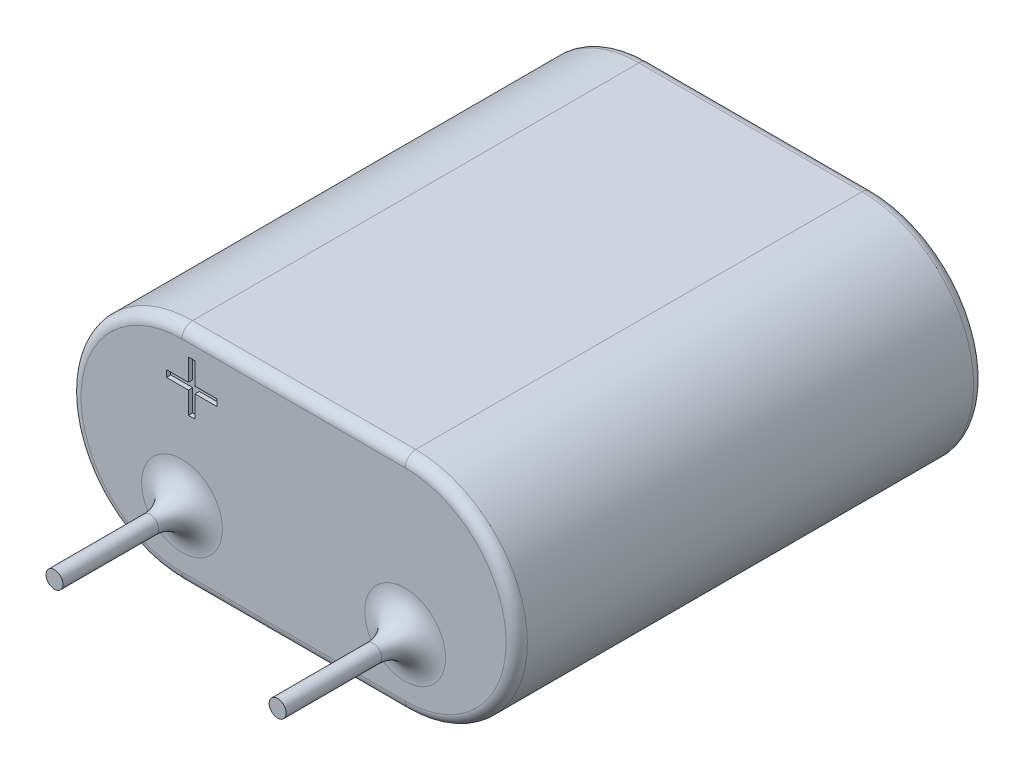
ISO-10303-21;
HEADER;
FILE_DESCRIPTION(('STEP AP214'),'2;1');
FILE_NAME('part.step','',(''),(''),'','','');
FILE_SCHEMA(('AUTOMOTIVE_DESIGN { 1 0 10303 214 1 1 1 1 }'));
ENDSEC;
DATA;
#1=APPLICATION_CONTEXT('core data for automotive mechanical design processes');
#2=APPLICATION_PROTOCOL_DEFINITION('international standard','automotive_design',2000,#1);
#3=PRODUCT_CONTEXT('',#1,'mechanical');
#4=PRODUCT('Part','Part','',(#3));
#5=PRODUCT_RELATED_PRODUCT_CATEGORY('part','',(#4));
#6=PRODUCT_DEFINITION_FORMATION('','',#4);
#7=PRODUCT_DEFINITION_CONTEXT('part definition',#1,'design');
#8=PRODUCT_DEFINITION('design','',#6,#7);
#9=PRODUCT_DEFINITION_SHAPE('','',#8);
#10=(LENGTH_UNIT() NAMED_UNIT(*) SI_UNIT(.MILLI.,.METRE.));
#11=(NAMED_UNIT(*) PLANE_ANGLE_UNIT() SI_UNIT($,.RADIAN.));
#12=(NAMED_UNIT(*) SI_UNIT($,.STERADIAN.) SOLID_ANGLE_UNIT());
#13=UNCERTAINTY_MEASURE_WITH_UNIT(LENGTH_MEASURE(1.E-05),#10,'distance_accuracy_value','');
#14=(GEOMETRIC_REPRESENTATION_CONTEXT(3) GLOBAL_UNCERTAINTY_ASSIGNED_CONTEXT((#13)) GLOBAL_UNIT_ASSIGNED_CONTEXT((#10,
#11,#12)) REPRESENTATION_CONTEXT('',''));
#15=CARTESIAN_POINT('',(0.,0.,0.));
#16=DIRECTION('',(0.,0.,1.));
#17=DIRECTION('',(1.,0.,0.));
#18=AXIS2_PLACEMENT_3D('',#15,#16,#17);
#19=CARTESIAN_POINT('',(0.,0.,0.));
#20=DIRECTION('',(0.,0.,1.));
#21=DIRECTION('',(1.,0.,0.));
#22=AXIS2_PLACEMENT_3D('',#19,#20,#21);
#23=PLANE('',#22);
#24=CARTESIAN_POINT('',(10.5,0.,0.));
#25=DIRECTION('',(0.,0.,1.));
#26=DIRECTION('',(1.,0.,0.));
#27=AXIS2_PLACEMENT_3D('',#24,#25,#26);
#28=CIRCLE('',#27,4.75);
#29=CARTESIAN_POINT('',(10.5,-4.75,0.));
#30=VERTEX_POINT('',#29);
#31=CARTESIAN_POINT('',(10.5,4.75,0.));
#32=VERTEX_POINT('',#31);
#33=EDGE_CURVE('E48',#30,#32,#28,.T.);
#34=ORIENTED_EDGE('',*,*,#33,.T.);
#35=DIRECTION('',(-1.,0.,0.));
#36=VECTOR('',#35,1.);
#37=CARTESIAN_POINT('',(0.,4.75,0.));
#38=LINE('',#37,#36);
#39=CARTESIAN_POINT('',(0.,4.75,0.));
#40=VERTEX_POINT('',#39);
#41=EDGE_CURVE('E11',#32,#40,#38,.T.);
#42=ORIENTED_EDGE('',*,*,#41,.T.);
#43=CARTESIAN_POINT('',(0.,0.,0.));
#44=DIRECTION('',(0.,0.,1.));
#45=DIRECTION('',(1.,0.,0.));
#46=AXIS2_PLACEMENT_3D('',#43,#44,#45);
#47=CIRCLE('',#46,4.75);
#48=CARTESIAN_POINT('',(0.,-4.75,0.));
#49=VERTEX_POINT('',#48);
#50=EDGE_CURVE('E265',#40,#49,#47,.T.);
#51=ORIENTED_EDGE('',*,*,#50,.T.);
#52=DIRECTION('',(1.,0.,0.));
#53=VECTOR('',#52,1.);
#54=CARTESIAN_POINT('',(0.,-4.75,0.));
#55=LINE('',#54,#53);
#56=EDGE_CURVE('E267',#49,#30,#55,.T.);
#57=ORIENTED_EDGE('',*,*,#56,.T.);
#58=EDGE_LOOP('',(#34,#42,#51,#57));
#59=FACE_BOUND('',#58,.T.);
#60=CARTESIAN_POINT('',(10.5,-2.05,0.));
#61=DIRECTION('',(0.,0.,1.));
#62=DIRECTION('',(1.,0.,0.));
#63=AXIS2_PLACEMENT_3D('',#60,#61,#62);
#64=CIRCLE('',#63,1.9);
#65=CARTESIAN_POINT('',(12.4,-2.05,0.));
#66=VERTEX_POINT('',#65);
#67=EDGE_CURVE('E232',#66,#66,#64,.F.);
#68=ORIENTED_EDGE('',*,*,#67,.T.);
#69=EDGE_LOOP('',(#68));
#70=FACE_BOUND('',#69,.T.);
#71=CARTESIAN_POINT('',(0.,-2.05,0.));
#72=DIRECTION('',(0.,0.,1.));
#73=DIRECTION('',(1.,0.,0.));
#74=AXIS2_PLACEMENT_3D('',#71,#72,#73);
#75=CIRCLE('',#74,1.9);
#76=CARTESIAN_POINT('',(1.9,-2.05,0.));
#77=VERTEX_POINT('',#76);
#78=EDGE_CURVE('E229',#77,#77,#75,.F.);
#79=ORIENTED_EDGE('',*,*,#78,.T.);
#80=EDGE_LOOP('',(#79));
#81=FACE_BOUND('',#80,.T.);
#82=DIRECTION('',(0.,1.,0.));
#83=VECTOR('',#82,1.);
#84=CARTESIAN_POINT('',(-0.73076923076923,2.82051282051282,0.));
#85=LINE('',#84,#83);
#86=CARTESIAN_POINT('',(-0.73076923076923,2.82051282051282,0.));
#87=VERTEX_POINT('',#86);
#88=CARTESIAN_POINT('',(-0.73076923076923,3.13461538461538,0.));
#89=VERTEX_POINT('',#88);
#90=EDGE_CURVE('E193',#87,#89,#85,.T.);
#91=ORIENTED_EDGE('',*,*,#90,.T.);
#92=DIRECTION('',(1.,0.,0.));
#93=VECTOR('',#92,1.);
#94=CARTESIAN_POINT('',(-0.73076923076923,3.13461538461538,0.));
#95=LINE('',#94,#93);
#96=CARTESIAN_POINT('',(0.301282051282052,3.13461538461538,0.));
#97=VERTEX_POINT('',#96);
#98=EDGE_CURVE('E56',#89,#97,#95,.T.);
#99=ORIENTED_EDGE('',*,*,#98,.T.);
#100=DIRECTION('',(0.,1.,0.));
#101=VECTOR('',#100,1.);
#102=CARTESIAN_POINT('',(0.301282051282052,3.13461538461538,0.));
#103=LINE('',#102,#101);
#104=CARTESIAN_POINT('',(0.301282051282052,4.16666666666667,0.));
#105=VERTEX_POINT('',#104);
#106=EDGE_CURVE('E197',#97,#105,#103,.T.);
#107=ORIENTED_EDGE('',*,*,#106,.T.);
#108=DIRECTION('',(1.,0.,0.));
#109=VECTOR('',#108,1.);
#110=CARTESIAN_POINT('',(0.301282051282052,4.16666666666667,0.));
#111=LINE('',#110,#109);
#112=CARTESIAN_POINT('',(0.615384615384616,4.16666666666667,0.));
#113=VERTEX_POINT('',#112);
#114=EDGE_CURVE('E643',#105,#113,#111,.T.);
#115=ORIENTED_EDGE('',*,*,#114,.T.);
#116=DIRECTION('',(0.,-1.,0.));
#117=VECTOR('',#116,1.);
#118=CARTESIAN_POINT('',(0.615384615384616,4.16666666666667,0.));
#119=LINE('',#118,#117);
#120=CARTESIAN_POINT('',(0.615384615384616,3.13461538461538,0.));
#121=VERTEX_POINT('',#120);
#122=EDGE_CURVE('E645',#113,#121,#119,.T.);
#123=ORIENTED_EDGE('',*,*,#122,.T.);
#124=DIRECTION('',(1.,0.,0.));
#125=VECTOR('',#124,1.);
#126=CARTESIAN_POINT('',(0.615384615384616,3.13461538461538,0.));
#127=LINE('',#126,#125);
#128=CARTESIAN_POINT('',(1.6474358974359,3.13461538461538,0.));
#129=VERTEX_POINT('',#128);
#130=EDGE_CURVE('E649',#121,#129,#127,.T.);
#131=ORIENTED_EDGE('',*,*,#130,.T.);
#132=DIRECTION('',(0.,-1.,0.));
#133=VECTOR('',#132,1.);
#134=CARTESIAN_POINT('',(1.6474358974359,3.13461538461538,0.));
#135=LINE('',#134,#133);
#136=CARTESIAN_POINT('',(1.6474358974359,2.82051282051282,0.));
#137=VERTEX_POINT('',#136);
#138=EDGE_CURVE('E656',#129,#137,#135,.T.);
#139=ORIENTED_EDGE('',*,*,#138,.T.);
#140=DIRECTION('',(-1.,0.,0.));
#141=VECTOR('',#140,1.);
#142=CARTESIAN_POINT('',(1.6474358974359,2.82051282051282,0.));
#143=LINE('',#142,#141);
#144=CARTESIAN_POINT('',(0.615384615384616,2.82051282051282,0.));
#145=VERTEX_POINT('',#144);
#146=EDGE_CURVE('E659',#137,#145,#143,.T.);
#147=ORIENTED_EDGE('',*,*,#146,.T.);
#148=DIRECTION('',(0.,-1.,0.));
#149=VECTOR('',#148,1.);
#150=CARTESIAN_POINT('',(0.615384615384616,2.82051282051282,0.));
#151=LINE('',#150,#149);
#152=CARTESIAN_POINT('',(0.615384615384616,1.78846153846154,0.));
#153=VERTEX_POINT('',#152);
#154=EDGE_CURVE('E662',#145,#153,#151,.T.);
#155=ORIENTED_EDGE('',*,*,#154,.T.);
#156=DIRECTION('',(-1.,0.,0.));
#157=VECTOR('',#156,1.);
#158=CARTESIAN_POINT('',(0.615384615384616,1.78846153846154,0.));
#159=LINE('',#158,#157);
#160=CARTESIAN_POINT('',(0.301282051282052,1.78846153846154,0.));
#161=VERTEX_POINT('',#160);
#162=EDGE_CURVE('E619',#153,#161,#159,.T.);
#163=ORIENTED_EDGE('',*,*,#162,.T.);
#164=DIRECTION('',(0.,1.,0.));
#165=VECTOR('',#164,1.);
#166=CARTESIAN_POINT('',(0.301282051282052,1.78846153846154,0.));
#167=LINE('',#166,#165);
#168=CARTESIAN_POINT('',(0.301282051282052,2.82051282051282,0.));
#169=VERTEX_POINT('',#168);
#170=EDGE_CURVE('E616',#161,#169,#167,.T.);
#171=ORIENTED_EDGE('',*,*,#170,.T.);
#172=DIRECTION('',(-1.,0.,0.));
#173=VECTOR('',#172,1.);
#174=CARTESIAN_POINT('',(0.301282051282052,2.82051282051282,0.));
#175=LINE('',#174,#173);
#176=EDGE_CURVE('E610',#169,#87,#175,.T.);
#177=ORIENTED_EDGE('',*,*,#176,.T.);
#178=EDGE_LOOP('',(#91,#99,#107,#115,#123,#131,#139,#147,#155,#163,#171,#177));
#179=FACE_BOUND('',#178,.T.);
#180=ADVANCED_FACE('F39',(#59,#70,#81,#179),#23,.T.);
#181=CARTESIAN_POINT('',(0.,0.,-22.));
#182=DIRECTION('',(0.,0.,1.));
#183=DIRECTION('',(1.,0.,0.));
#184=AXIS2_PLACEMENT_3D('',#181,#182,#183);
#185=CYLINDRICAL_SURFACE('',#184,5.25);
#186=DIRECTION('',(0.,0.,1.));
#187=VECTOR('',#186,1.);
#188=CARTESIAN_POINT('',(0.,5.25,-22.));
#189=LINE('',#188,#187);
#190=CARTESIAN_POINT('',(0.,5.25,-21.5));
#191=VERTEX_POINT('',#190);
#192=CARTESIAN_POINT('',(0.,5.25,-0.5));
#193=VERTEX_POINT('',#192);
#194=EDGE_CURVE('E215',#191,#193,#189,.T.);
#195=ORIENTED_EDGE('',*,*,#194,.F.);
#196=CARTESIAN_POINT('',(0.,0.,-21.5));
#197=DIRECTION('',(0.,0.,1.));
#198=DIRECTION('',(1.,0.,0.));
#199=AXIS2_PLACEMENT_3D('',#196,#197,#198);
#200=CIRCLE('',#199,5.25);
#201=CARTESIAN_POINT('',(0.,-5.25,-21.5));
#202=VERTEX_POINT('',#201);
#203=EDGE_CURVE('E263',#191,#202,#200,.T.);
#204=ORIENTED_EDGE('',*,*,#203,.T.);
#205=DIRECTION('',(0.,0.,1.));
#206=VECTOR('',#205,1.);
#207=CARTESIAN_POINT('',(0.,-5.25,-22.));
#208=LINE('',#207,#206);
#209=CARTESIAN_POINT('',(0.,-5.25,-0.5));
#210=VERTEX_POINT('',#209);
#211=EDGE_CURVE('E214',#202,#210,#208,.T.);
#212=ORIENTED_EDGE('',*,*,#211,.T.);
#213=CARTESIAN_POINT('',(0.,0.,-0.5));
#214=DIRECTION('',(0.,0.,1.));
#215=DIRECTION('',(1.,0.,0.));
#216=AXIS2_PLACEMENT_3D('',#213,#214,#215);
#217=CIRCLE('',#216,5.25);
#218=EDGE_CURVE('E261',#210,#193,#217,.F.);
#219=ORIENTED_EDGE('',*,*,#218,.T.);
#220=EDGE_LOOP('',(#195,#204,#212,#219));
#221=FACE_BOUND('',#220,.T.);
#222=ADVANCED_FACE('F300',(#221),#185,.T.);
#223=CARTESIAN_POINT('',(0.,5.25,-22.));
#224=DIRECTION('',(0.,1.,0.));
#225=DIRECTION('',(-1.,0.,0.));
#226=AXIS2_PLACEMENT_3D('',#223,#224,#225);
#227=PLANE('',#226);
#228=DIRECTION('',(0.,0.,1.));
#229=VECTOR('',#228,1.);
#230=CARTESIAN_POINT('',(10.5,5.25,-22.));
#231=LINE('',#230,#229);
#232=CARTESIAN_POINT('',(10.5,5.25,-21.5));
#233=VERTEX_POINT('',#232);
#234=CARTESIAN_POINT('',(10.5,5.25,-0.5));
#235=VERTEX_POINT('',#234);
#236=EDGE_CURVE('E219',#233,#235,#231,.T.);
#237=ORIENTED_EDGE('',*,*,#236,.F.);
#238=DIRECTION('',(-1.,0.,0.));
#239=VECTOR('',#238,1.);
#240=CARTESIAN_POINT('',(0.,5.25,-21.5));
#241=LINE('',#240,#239);
#242=EDGE_CURVE('E259',#233,#191,#241,.T.);
#243=ORIENTED_EDGE('',*,*,#242,.T.);
#244=ORIENTED_EDGE('',*,*,#194,.T.);
#245=DIRECTION('',(-1.,0.,0.));
#246=VECTOR('',#245,1.);
#247=CARTESIAN_POINT('',(0.,5.25,-0.5));
#248=LINE('',#247,#246);
#249=EDGE_CURVE('E256',#193,#235,#248,.F.);
#250=ORIENTED_EDGE('',*,*,#249,.T.);
#251=EDGE_LOOP('',(#237,#243,#244,#250));
#252=FACE_BOUND('',#251,.T.);
#253=ADVANCED_FACE('F317',(#252),#227,.T.);
#254=CARTESIAN_POINT('',(10.5,0.,-22.));
#255=DIRECTION('',(0.,0.,1.));
#256=DIRECTION('',(1.,0.,0.));
#257=AXIS2_PLACEMENT_3D('',#254,#255,#256);
#258=CYLINDRICAL_SURFACE('',#257,5.25);
#259=DIRECTION('',(0.,0.,1.));
#260=VECTOR('',#259,1.);
#261=CARTESIAN_POINT('',(10.5,-5.25,-22.));
#262=LINE('',#261,#260);
#263=CARTESIAN_POINT('',(10.5,-5.25,-21.5));
#264=VERTEX_POINT('',#263);
#265=CARTESIAN_POINT('',(10.5,-5.25,-0.5));
#266=VERTEX_POINT('',#265);
#267=EDGE_CURVE('E222',#264,#266,#262,.T.);
#268=ORIENTED_EDGE('',*,*,#267,.F.);
#269=CARTESIAN_POINT('',(10.5,0.,-21.5));
#270=DIRECTION('',(0.,0.,1.));
#271=DIRECTION('',(1.,0.,0.));
#272=AXIS2_PLACEMENT_3D('',#269,#270,#271);
#273=CIRCLE('',#272,5.25);
#274=EDGE_CURVE('E254',#264,#233,#273,.T.);
#275=ORIENTED_EDGE('',*,*,#274,.T.);
#276=ORIENTED_EDGE('',*,*,#236,.T.);
#277=CARTESIAN_POINT('',(10.5,0.,-0.5));
#278=DIRECTION('',(0.,0.,1.));
#279=DIRECTION('',(1.,0.,0.));
#280=AXIS2_PLACEMENT_3D('',#277,#278,#279);
#281=CIRCLE('',#280,5.25);
#282=EDGE_CURVE('E252',#235,#266,#281,.F.);
#283=ORIENTED_EDGE('',*,*,#282,.T.);
#284=EDGE_LOOP('',(#268,#275,#276,#283));
#285=FACE_BOUND('',#284,.T.);
#286=ADVANCED_FACE('F313',(#285),#258,.T.);
#287=CARTESIAN_POINT('',(0.,-5.25,-22.));
#288=DIRECTION('',(0.,-1.,0.));
#289=DIRECTION('',(1.,0.,0.));
#290=AXIS2_PLACEMENT_3D('',#287,#288,#289);
#291=PLANE('',#290);
#292=ORIENTED_EDGE('',*,*,#211,.F.);
#293=DIRECTION('',(1.,0.,0.));
#294=VECTOR('',#293,1.);
#295=CARTESIAN_POINT('',(10.5,-5.25,-21.5));
#296=LINE('',#295,#294);
#297=EDGE_CURVE('E240',#202,#264,#296,.T.);
#298=ORIENTED_EDGE('',*,*,#297,.T.);
#299=ORIENTED_EDGE('',*,*,#267,.T.);
#300=DIRECTION('',(1.,0.,0.));
#301=VECTOR('',#300,1.);
#302=CARTESIAN_POINT('',(0.,-5.25,-0.5));
#303=LINE('',#302,#301);
#304=EDGE_CURVE('E238',#266,#210,#303,.F.);
#305=ORIENTED_EDGE('',*,*,#304,.T.);
#306=EDGE_LOOP('',(#292,#298,#299,#305));
#307=FACE_BOUND('',#306,.T.);
#308=ADVANCED_FACE('F295',(#307),#291,.T.);
#309=CARTESIAN_POINT('',(0.,0.,-22.));
#310=DIRECTION('',(0.,0.,1.));
#311=DIRECTION('',(1.,0.,0.));
#312=AXIS2_PLACEMENT_3D('',#309,#310,#311);
#313=PLANE('',#312);
#314=CARTESIAN_POINT('',(10.5,0.,-22.));
#315=DIRECTION('',(0.,0.,1.));
#316=DIRECTION('',(1.,0.,0.));
#317=AXIS2_PLACEMENT_3D('',#314,#315,#316);
#318=CIRCLE('',#317,4.75);
#319=CARTESIAN_POINT('',(10.5,4.75,-22.));
#320=VERTEX_POINT('',#319);
#321=CARTESIAN_POINT('',(10.5,-4.75,-22.));
#322=VERTEX_POINT('',#321);
#323=EDGE_CURVE('E247',#320,#322,#318,.F.);
#324=ORIENTED_EDGE('',*,*,#323,.T.);
#325=DIRECTION('',(1.,0.,0.));
#326=VECTOR('',#325,1.);
#327=CARTESIAN_POINT('',(0.,-4.75,-22.));
#328=LINE('',#327,#326);
#329=CARTESIAN_POINT('',(0.,-4.75,-22.));
#330=VERTEX_POINT('',#329);
#331=EDGE_CURVE('E249',#322,#330,#328,.F.);
#332=ORIENTED_EDGE('',*,*,#331,.T.);
#333=CARTESIAN_POINT('',(0.,0.,-22.));
#334=DIRECTION('',(0.,0.,1.));
#335=DIRECTION('',(1.,0.,0.));
#336=AXIS2_PLACEMENT_3D('',#333,#334,#335);
#337=CIRCLE('',#336,4.75);
#338=CARTESIAN_POINT('',(0.,4.75,-22.));
#339=VERTEX_POINT('',#338);
#340=EDGE_CURVE('E243',#330,#339,#337,.F.);
#341=ORIENTED_EDGE('',*,*,#340,.T.);
#342=DIRECTION('',(-1.,0.,0.));
#343=VECTOR('',#342,1.);
#344=CARTESIAN_POINT('',(10.5,4.75,-22.));
#345=LINE('',#344,#343);
#346=EDGE_CURVE('E245',#339,#320,#345,.F.);
#347=ORIENTED_EDGE('',*,*,#346,.T.);
#348=EDGE_LOOP('',(#324,#332,#341,#347));
#349=FACE_BOUND('',#348,.T.);
#350=ADVANCED_FACE('F327',(#349),#313,.F.);
#351=CARTESIAN_POINT('',(0.,-2.05,6.));
#352=DIRECTION('',(0.,0.,1.));
#353=DIRECTION('',(1.,0.,0.));
#354=AXIS2_PLACEMENT_3D('',#351,#352,#353);
#355=PLANE('',#354);
#356=CARTESIAN_POINT('',(0.,-2.05,6.));
#357=DIRECTION('',(0.,0.,1.));
#358=DIRECTION('',(1.,0.,0.));
#359=AXIS2_PLACEMENT_3D('',#356,#357,#358);
#360=CIRCLE('',#359,0.4);
#361=CARTESIAN_POINT('',(0.4,-2.05,6.));
#362=VERTEX_POINT('',#361);
#363=EDGE_CURVE('E210',#362,#362,#360,.T.);
#364=ORIENTED_EDGE('',*,*,#363,.T.);
#365=EDGE_LOOP('',(#364));
#366=FACE_BOUND('',#365,.T.);
#367=ADVANCED_FACE('F329',(#366),#355,.T.);
#368=CARTESIAN_POINT('',(0.,-2.05,0.));
#369=DIRECTION('',(0.,0.,1.));
#370=DIRECTION('',(1.,0.,0.));
#371=AXIS2_PLACEMENT_3D('',#368,#369,#370);
#372=CYLINDRICAL_SURFACE('',#371,0.4);
#373=CARTESIAN_POINT('',(0.,-2.05,1.5));
#374=DIRECTION('',(0.,0.,1.));
#375=DIRECTION('',(1.,0.,0.));
#376=AXIS2_PLACEMENT_3D('',#373,#374,#375);
#377=CIRCLE('',#376,0.4);
#378=CARTESIAN_POINT('',(0.4,-2.05,1.5));
#379=VERTEX_POINT('',#378);
#380=EDGE_CURVE('E235',#379,#379,#377,.T.);
#381=ORIENTED_EDGE('',*,*,#380,.T.);
#382=EDGE_LOOP('',(#381));
#383=FACE_BOUND('',#382,.T.);
#384=ORIENTED_EDGE('',*,*,#363,.F.);
#385=EDGE_LOOP('',(#384));
#386=FACE_BOUND('',#385,.T.);
#387=ADVANCED_FACE('F331',(#383,#386),#372,.T.);
#388=CARTESIAN_POINT('',(10.5,-2.05,6.));
#389=DIRECTION('',(0.,0.,1.));
#390=DIRECTION('',(1.,0.,0.));
#391=AXIS2_PLACEMENT_3D('',#388,#389,#390);
#392=PLANE('',#391);
#393=CARTESIAN_POINT('',(10.5,-2.05,6.));
#394=DIRECTION('',(0.,0.,1.));
#395=DIRECTION('',(1.,0.,0.));
#396=AXIS2_PLACEMENT_3D('',#393,#394,#395);
#397=CIRCLE('',#396,0.399999999999999);
#398=CARTESIAN_POINT('',(10.9,-2.05,6.));
#399=VERTEX_POINT('',#398);
#400=EDGE_CURVE('E207',#399,#399,#397,.T.);
#401=ORIENTED_EDGE('',*,*,#400,.T.);
#402=EDGE_LOOP('',(#401));
#403=FACE_BOUND('',#402,.T.);
#404=ADVANCED_FACE('F342',(#403),#392,.T.);
#405=CARTESIAN_POINT('',(10.5,-2.05,0.));
#406=DIRECTION('',(0.,0.,1.));
#407=DIRECTION('',(1.,0.,0.));
#408=AXIS2_PLACEMENT_3D('',#405,#406,#407);
#409=CYLINDRICAL_SURFACE('',#408,0.399999999999999);
#410=CARTESIAN_POINT('',(10.5,-2.05,1.5));
#411=DIRECTION('',(0.,0.,1.));
#412=DIRECTION('',(1.,0.,0.));
#413=AXIS2_PLACEMENT_3D('',#410,#411,#412);
#414=CIRCLE('',#413,0.399999999999999);
#415=CARTESIAN_POINT('',(10.9,-2.05,1.5));
#416=VERTEX_POINT('',#415);
#417=EDGE_CURVE('E218',#416,#416,#414,.T.);
#418=ORIENTED_EDGE('',*,*,#417,.T.);
#419=EDGE_LOOP('',(#418));
#420=FACE_BOUND('',#419,.T.);
#421=ORIENTED_EDGE('',*,*,#400,.F.);
#422=EDGE_LOOP('',(#421));
#423=FACE_BOUND('',#422,.T.);
#424=ADVANCED_FACE('F338',(#420,#423),#409,.T.);
#425=CARTESIAN_POINT('',(10.5,-2.05,1.5));
#426=DIRECTION('',(0.,0.,1.));
#427=DIRECTION('',(1.,0.,0.));
#428=AXIS2_PLACEMENT_3D('',#425,#426,#427);
#429=TOROIDAL_SURFACE('',#428,1.9,1.5);
#430=ORIENTED_EDGE('',*,*,#67,.F.);
#431=EDGE_LOOP('',(#430));
#432=FACE_BOUND('',#431,.T.);
#433=ORIENTED_EDGE('',*,*,#417,.F.);
#434=EDGE_LOOP('',(#433));
#435=FACE_BOUND('',#434,.T.);
#436=ADVANCED_FACE('F356',(#432,#435),#429,.F.);
#437=CARTESIAN_POINT('',(0.,-2.05,1.5));
#438=DIRECTION('',(0.,0.,1.));
#439=DIRECTION('',(1.,0.,0.));
#440=AXIS2_PLACEMENT_3D('',#437,#438,#439);
#441=TOROIDAL_SURFACE('',#440,1.9,1.5);
#442=ORIENTED_EDGE('',*,*,#78,.F.);
#443=EDGE_LOOP('',(#442));
#444=FACE_BOUND('',#443,.T.);
#445=ORIENTED_EDGE('',*,*,#380,.F.);
#446=EDGE_LOOP('',(#445));
#447=FACE_BOUND('',#446,.T.);
#448=ADVANCED_FACE('F359',(#444,#447),#441,.F.);
#449=CARTESIAN_POINT('',(0.,4.75,-21.5));
#450=DIRECTION('',(1.,0.,0.));
#451=DIRECTION('',(0.,1.,0.));
#452=AXIS2_PLACEMENT_3D('',#449,#450,#451);
#453=CYLINDRICAL_SURFACE('',#452,0.5);
#454=CARTESIAN_POINT('',(10.5,4.75,-21.5));
#455=DIRECTION('',(1.,0.,0.));
#456=DIRECTION('',(0.,0.,-1.));
#457=AXIS2_PLACEMENT_3D('',#454,#455,#456);
#458=CIRCLE('',#457,0.5);
#459=EDGE_CURVE('E274',#320,#233,#458,.T.);
#460=ORIENTED_EDGE('',*,*,#459,.F.);
#461=ORIENTED_EDGE('',*,*,#346,.F.);
#462=CARTESIAN_POINT('',(0.,4.75,-21.5));
#463=DIRECTION('',(-1.,0.,0.));
#464=DIRECTION('',(0.,-1.,0.));
#465=AXIS2_PLACEMENT_3D('',#462,#463,#464);
#466=CIRCLE('',#465,0.5);
#467=EDGE_CURVE('E211',#191,#339,#466,.T.);
#468=ORIENTED_EDGE('',*,*,#467,.F.);
#469=ORIENTED_EDGE('',*,*,#242,.F.);
#470=EDGE_LOOP('',(#460,#461,#468,#469));
#471=FACE_BOUND('',#470,.T.);
#472=ADVANCED_FACE('F321',(#471),#453,.T.);
#473=CARTESIAN_POINT('',(0.,0.,-21.5));
#474=DIRECTION('',(0.,0.,1.));
#475=DIRECTION('',(1.,0.,0.));
#476=AXIS2_PLACEMENT_3D('',#473,#474,#475);
#477=TOROIDAL_SURFACE('',#476,4.75,0.5);
#478=ORIENTED_EDGE('',*,*,#467,.T.);
#479=ORIENTED_EDGE('',*,*,#340,.F.);
#480=CARTESIAN_POINT('',(0.,-4.75,-21.5));
#481=DIRECTION('',(1.,0.,0.));
#482=DIRECTION('',(0.,0.,-1.));
#483=AXIS2_PLACEMENT_3D('',#480,#481,#482);
#484=CIRCLE('',#483,0.5);
#485=EDGE_CURVE('E272',#202,#330,#484,.T.);
#486=ORIENTED_EDGE('',*,*,#485,.F.);
#487=ORIENTED_EDGE('',*,*,#203,.F.);
#488=EDGE_LOOP('',(#478,#479,#486,#487));
#489=FACE_BOUND('',#488,.T.);
#490=ADVANCED_FACE('F304',(#489),#477,.T.);
#491=CARTESIAN_POINT('',(10.5,0.,-21.5));
#492=DIRECTION('',(0.,0.,1.));
#493=DIRECTION('',(1.,0.,0.));
#494=AXIS2_PLACEMENT_3D('',#491,#492,#493);
#495=TOROIDAL_SURFACE('',#494,4.75,0.5);
#496=ORIENTED_EDGE('',*,*,#459,.T.);
#497=ORIENTED_EDGE('',*,*,#274,.F.);
#498=CARTESIAN_POINT('',(10.5,-4.75,-21.5));
#499=DIRECTION('',(-1.,0.,0.));
#500=DIRECTION('',(0.,0.,1.));
#501=AXIS2_PLACEMENT_3D('',#498,#499,#500);
#502=CIRCLE('',#501,0.5);
#503=EDGE_CURVE('E270',#322,#264,#502,.T.);
#504=ORIENTED_EDGE('',*,*,#503,.F.);
#505=ORIENTED_EDGE('',*,*,#323,.F.);
#506=EDGE_LOOP('',(#496,#497,#504,#505));
#507=FACE_BOUND('',#506,.T.);
#508=ADVANCED_FACE('F325',(#507),#495,.T.);
#509=CARTESIAN_POINT('',(0.,-4.75,-21.5));
#510=DIRECTION('',(-1.,0.,0.));
#511=DIRECTION('',(0.,-1.,0.));
#512=AXIS2_PLACEMENT_3D('',#509,#510,#511);
#513=CYLINDRICAL_SURFACE('',#512,0.5);
#514=ORIENTED_EDGE('',*,*,#485,.T.);
#515=ORIENTED_EDGE('',*,*,#331,.F.);
#516=ORIENTED_EDGE('',*,*,#503,.T.);
#517=ORIENTED_EDGE('',*,*,#297,.F.);
#518=EDGE_LOOP('',(#514,#515,#516,#517));
#519=FACE_BOUND('',#518,.T.);
#520=ADVANCED_FACE('F309',(#519),#513,.T.);
#521=CARTESIAN_POINT('',(0.,-4.75,-0.5));
#522=DIRECTION('',(1.,0.,0.));
#523=DIRECTION('',(0.,1.,0.));
#524=AXIS2_PLACEMENT_3D('',#521,#522,#523);
#525=CYLINDRICAL_SURFACE('',#524,0.5);
#526=CARTESIAN_POINT('',(0.,-4.75,-0.5));
#527=DIRECTION('',(-1.,0.,0.));
#528=DIRECTION('',(0.,-1.,0.));
#529=AXIS2_PLACEMENT_3D('',#526,#527,#528);
#530=CIRCLE('',#529,0.5);
#531=EDGE_CURVE('E279',#210,#49,#530,.T.);
#532=ORIENTED_EDGE('',*,*,#531,.F.);
#533=ORIENTED_EDGE('',*,*,#304,.F.);
#534=CARTESIAN_POINT('',(10.5,-4.75,-0.5));
#535=DIRECTION('',(1.,0.,0.));
#536=DIRECTION('',(0.,0.,-1.));
#537=AXIS2_PLACEMENT_3D('',#534,#535,#536);
#538=CIRCLE('',#537,0.5);
#539=EDGE_CURVE('E43',#30,#266,#538,.T.);
#540=ORIENTED_EDGE('',*,*,#539,.F.);
#541=ORIENTED_EDGE('',*,*,#56,.F.);
#542=EDGE_LOOP('',(#532,#533,#540,#541));
#543=FACE_BOUND('',#542,.T.);
#544=ADVANCED_FACE('F41',(#543),#525,.T.);
#545=CARTESIAN_POINT('',(10.5,0.,-0.5));
#546=DIRECTION('',(0.,0.,1.));
#547=DIRECTION('',(1.,0.,0.));
#548=AXIS2_PLACEMENT_3D('',#545,#546,#547);
#549=TOROIDAL_SURFACE('',#548,4.75,0.5);
#550=ORIENTED_EDGE('',*,*,#539,.T.);
#551=ORIENTED_EDGE('',*,*,#282,.F.);
#552=CARTESIAN_POINT('',(10.5,4.75,-0.5));
#553=DIRECTION('',(-1.,0.,0.));
#554=DIRECTION('',(0.,0.,1.));
#555=AXIS2_PLACEMENT_3D('',#552,#553,#554);
#556=CIRCLE('',#555,0.5);
#557=EDGE_CURVE('E201',#32,#235,#556,.T.);
#558=ORIENTED_EDGE('',*,*,#557,.F.);
#559=ORIENTED_EDGE('',*,*,#33,.F.);
#560=EDGE_LOOP('',(#550,#551,#558,#559));
#561=FACE_BOUND('',#560,.T.);
#562=ADVANCED_FACE('F289',(#561),#549,.T.);
#563=CARTESIAN_POINT('',(0.,0.,-0.5));
#564=DIRECTION('',(0.,0.,1.));
#565=DIRECTION('',(1.,0.,0.));
#566=AXIS2_PLACEMENT_3D('',#563,#564,#565);
#567=TOROIDAL_SURFACE('',#566,4.75,0.5);
#568=ORIENTED_EDGE('',*,*,#531,.T.);
#569=ORIENTED_EDGE('',*,*,#50,.F.);
#570=CARTESIAN_POINT('',(0.,4.75,-0.5));
#571=DIRECTION('',(1.,0.,0.));
#572=DIRECTION('',(0.,0.,-1.));
#573=AXIS2_PLACEMENT_3D('',#570,#571,#572);
#574=CIRCLE('',#573,0.5);
#575=EDGE_CURVE('E198',#193,#40,#574,.T.);
#576=ORIENTED_EDGE('',*,*,#575,.F.);
#577=ORIENTED_EDGE('',*,*,#218,.F.);
#578=EDGE_LOOP('',(#568,#569,#576,#577));
#579=FACE_BOUND('',#578,.T.);
#580=ADVANCED_FACE('F375',(#579),#567,.T.);
#581=CARTESIAN_POINT('',(0.,4.75,-0.5));
#582=DIRECTION('',(-1.,0.,0.));
#583=DIRECTION('',(0.,-1.,0.));
#584=AXIS2_PLACEMENT_3D('',#581,#582,#583);
#585=CYLINDRICAL_SURFACE('',#584,0.5);
#586=ORIENTED_EDGE('',*,*,#557,.T.);
#587=ORIENTED_EDGE('',*,*,#249,.F.);
#588=ORIENTED_EDGE('',*,*,#575,.T.);
#589=ORIENTED_EDGE('',*,*,#41,.F.);
#590=EDGE_LOOP('',(#586,#587,#588,#589));
#591=FACE_BOUND('',#590,.T.);
#592=ADVANCED_FACE('F372',(#591),#585,.T.);
#593=CARTESIAN_POINT('',(-0.73076923076923,3.13461538461538,-0.2));
#594=DIRECTION('',(0.,-1.,0.));
#595=DIRECTION('',(0.,0.,-1.));
#596=AXIS2_PLACEMENT_3D('',#593,#594,#595);
#597=PLANE('',#596);
#598=ORIENTED_EDGE('',*,*,#98,.F.);
#599=DIRECTION('',(0.,0.,1.));
#600=VECTOR('',#599,1.);
#601=CARTESIAN_POINT('',(-0.73076923076923,3.13461538461538,-0.2));
#602=LINE('',#601,#600);
#603=CARTESIAN_POINT('',(-0.73076923076923,3.13461538461538,-0.2));
#604=VERTEX_POINT('',#603);
#605=EDGE_CURVE('E192',#604,#89,#602,.T.);
#606=ORIENTED_EDGE('',*,*,#605,.F.);
#607=DIRECTION('',(1.,0.,0.));
#608=VECTOR('',#607,1.);
#609=CARTESIAN_POINT('',(-0.73076923076923,3.13461538461538,-0.2));
#610=LINE('',#609,#608);
#611=CARTESIAN_POINT('',(0.301282051282052,3.13461538461538,-0.2));
#612=VERTEX_POINT('',#611);
#613=EDGE_CURVE('E183',#604,#612,#610,.T.);
#614=ORIENTED_EDGE('',*,*,#613,.T.);
#615=DIRECTION('',(0.,0.,1.));
#616=VECTOR('',#615,1.);
#617=CARTESIAN_POINT('',(0.301282051282052,3.13461538461538,-0.2));
#618=LINE('',#617,#616);
#619=EDGE_CURVE('E191',#612,#97,#618,.T.);
#620=ORIENTED_EDGE('',*,*,#619,.T.);
#621=EDGE_LOOP('',(#598,#606,#614,#620));
#622=FACE_BOUND('',#621,.T.);
#623=ADVANCED_FACE('F190',(#622),#597,.T.);
#624=CARTESIAN_POINT('',(0.301282051282052,3.13461538461538,-0.2));
#625=DIRECTION('',(1.,0.,0.));
#626=DIRECTION('',(0.,0.,-1.));
#627=AXIS2_PLACEMENT_3D('',#624,#625,#626);
#628=PLANE('',#627);
#629=ORIENTED_EDGE('',*,*,#106,.F.);
#630=ORIENTED_EDGE('',*,*,#619,.F.);
#631=DIRECTION('',(0.,1.,0.));
#632=VECTOR('',#631,1.);
#633=CARTESIAN_POINT('',(0.301282051282052,3.13461538461538,-0.2));
#634=LINE('',#633,#632);
#635=CARTESIAN_POINT('',(0.301282051282052,4.16666666666667,-0.2));
#636=VERTEX_POINT('',#635);
#637=EDGE_CURVE('E179',#612,#636,#634,.T.);
#638=ORIENTED_EDGE('',*,*,#637,.T.);
#639=DIRECTION('',(0.,0.,1.));
#640=VECTOR('',#639,1.);
#641=CARTESIAN_POINT('',(0.301282051282052,4.16666666666667,-0.2));
#642=LINE('',#641,#640);
#643=EDGE_CURVE('E199',#636,#105,#642,.T.);
#644=ORIENTED_EDGE('',*,*,#643,.T.);
#645=EDGE_LOOP('',(#629,#630,#638,#644));
#646=FACE_BOUND('',#645,.T.);
#647=ADVANCED_FACE('F195',(#646),#628,.T.);
#648=CARTESIAN_POINT('',(0.301282051282052,4.16666666666667,-0.2));
#649=DIRECTION('',(0.,-1.,0.));
#650=DIRECTION('',(0.,0.,-1.));
#651=AXIS2_PLACEMENT_3D('',#648,#649,#650);
#652=PLANE('',#651);
#653=ORIENTED_EDGE('',*,*,#114,.F.);
#654=ORIENTED_EDGE('',*,*,#643,.F.);
#655=DIRECTION('',(1.,0.,0.));
#656=VECTOR('',#655,1.);
#657=CARTESIAN_POINT('',(0.301282051282052,4.16666666666667,-0.2));
#658=LINE('',#657,#656);
#659=CARTESIAN_POINT('',(0.615384615384616,4.16666666666667,-0.2));
#660=VERTEX_POINT('',#659);
#661=EDGE_CURVE('E185',#636,#660,#658,.T.);
#662=ORIENTED_EDGE('',*,*,#661,.T.);
#663=DIRECTION('',(0.,0.,1.));
#664=VECTOR('',#663,1.);
#665=CARTESIAN_POINT('',(0.615384615384616,4.16666666666667,-0.2));
#666=LINE('',#665,#664);
#667=EDGE_CURVE('E203',#660,#113,#666,.T.);
#668=ORIENTED_EDGE('',*,*,#667,.T.);
#669=EDGE_LOOP('',(#653,#654,#662,#668));
#670=FACE_BOUND('',#669,.T.);
#671=ADVANCED_FACE('F491',(#670),#652,.T.);
#672=CARTESIAN_POINT('',(0.615384615384616,4.16666666666667,-0.2));
#673=DIRECTION('',(-1.,0.,0.));
#674=DIRECTION('',(0.,0.,1.));
#675=AXIS2_PLACEMENT_3D('',#672,#673,#674);
#676=PLANE('',#675);
#677=ORIENTED_EDGE('',*,*,#122,.F.);
#678=ORIENTED_EDGE('',*,*,#667,.F.);
#679=DIRECTION('',(0.,-1.,0.));
#680=VECTOR('',#679,1.);
#681=CARTESIAN_POINT('',(0.615384615384616,4.16666666666667,-0.2));
#682=LINE('',#681,#680);
#683=CARTESIAN_POINT('',(0.615384615384616,3.13461538461538,-0.2));
#684=VERTEX_POINT('',#683);
#685=EDGE_CURVE('E687',#660,#684,#682,.T.);
#686=ORIENTED_EDGE('',*,*,#685,.T.);
#687=DIRECTION('',(0.,0.,1.));
#688=VECTOR('',#687,1.);
#689=CARTESIAN_POINT('',(0.615384615384616,3.13461538461538,-0.2));
#690=LINE('',#689,#688);
#691=EDGE_CURVE('E638',#684,#121,#690,.T.);
#692=ORIENTED_EDGE('',*,*,#691,.T.);
#693=EDGE_LOOP('',(#677,#678,#686,#692));
#694=FACE_BOUND('',#693,.T.);
#695=ADVANCED_FACE('F499',(#694),#676,.T.);
#696=CARTESIAN_POINT('',(0.615384615384616,3.13461538461538,-0.2));
#697=DIRECTION('',(0.,-1.,0.));
#698=DIRECTION('',(0.,0.,-1.));
#699=AXIS2_PLACEMENT_3D('',#696,#697,#698);
#700=PLANE('',#699);
#701=ORIENTED_EDGE('',*,*,#130,.F.);
#702=ORIENTED_EDGE('',*,*,#691,.F.);
#703=DIRECTION('',(1.,0.,0.));
#704=VECTOR('',#703,1.);
#705=CARTESIAN_POINT('',(0.615384615384616,3.13461538461538,-0.2));
#706=LINE('',#705,#704);
#707=CARTESIAN_POINT('',(1.6474358974359,3.13461538461538,-0.2));
#708=VERTEX_POINT('',#707);
#709=EDGE_CURVE('E685',#684,#708,#706,.T.);
#710=ORIENTED_EDGE('',*,*,#709,.T.);
#711=DIRECTION('',(0.,0.,1.));
#712=VECTOR('',#711,1.);
#713=CARTESIAN_POINT('',(1.6474358974359,3.13461538461538,-0.2));
#714=LINE('',#713,#712);
#715=EDGE_CURVE('E636',#708,#129,#714,.T.);
#716=ORIENTED_EDGE('',*,*,#715,.T.);
#717=EDGE_LOOP('',(#701,#702,#710,#716));
#718=FACE_BOUND('',#717,.T.);
#719=ADVANCED_FACE('F508',(#718),#700,.T.);
#720=CARTESIAN_POINT('',(1.6474358974359,3.13461538461538,-0.2));
#721=DIRECTION('',(-1.,0.,0.));
#722=DIRECTION('',(0.,0.,1.));
#723=AXIS2_PLACEMENT_3D('',#720,#721,#722);
#724=PLANE('',#723);
#725=ORIENTED_EDGE('',*,*,#138,.F.);
#726=ORIENTED_EDGE('',*,*,#715,.F.);
#727=DIRECTION('',(0.,-1.,0.));
#728=VECTOR('',#727,1.);
#729=CARTESIAN_POINT('',(1.6474358974359,3.13461538461538,-0.2));
#730=LINE('',#729,#728);
#731=CARTESIAN_POINT('',(1.6474358974359,2.82051282051282,-0.2));
#732=VERTEX_POINT('',#731);
#733=EDGE_CURVE('E683',#708,#732,#730,.T.);
#734=ORIENTED_EDGE('',*,*,#733,.T.);
#735=DIRECTION('',(0.,0.,1.));
#736=VECTOR('',#735,1.);
#737=CARTESIAN_POINT('',(1.6474358974359,2.82051282051282,-0.2));
#738=LINE('',#737,#736);
#739=EDGE_CURVE('E634',#732,#137,#738,.T.);
#740=ORIENTED_EDGE('',*,*,#739,.T.);
#741=EDGE_LOOP('',(#725,#726,#734,#740));
#742=FACE_BOUND('',#741,.T.);
#743=ADVANCED_FACE('F517',(#742),#724,.T.);
#744=CARTESIAN_POINT('',(1.6474358974359,2.82051282051282,-0.2));
#745=DIRECTION('',(0.,1.,0.));
#746=DIRECTION('',(0.,0.,1.));
#747=AXIS2_PLACEMENT_3D('',#744,#745,#746);
#748=PLANE('',#747);
#749=ORIENTED_EDGE('',*,*,#146,.F.);
#750=ORIENTED_EDGE('',*,*,#739,.F.);
#751=DIRECTION('',(-1.,0.,0.));
#752=VECTOR('',#751,1.);
#753=CARTESIAN_POINT('',(1.6474358974359,2.82051282051282,-0.2));
#754=LINE('',#753,#752);
#755=CARTESIAN_POINT('',(0.615384615384616,2.82051282051282,-0.2));
#756=VERTEX_POINT('',#755);
#757=EDGE_CURVE('E681',#732,#756,#754,.T.);
#758=ORIENTED_EDGE('',*,*,#757,.T.);
#759=DIRECTION('',(0.,0.,1.));
#760=VECTOR('',#759,1.);
#761=CARTESIAN_POINT('',(0.615384615384616,2.82051282051282,-0.2));
#762=LINE('',#761,#760);
#763=EDGE_CURVE('E632',#756,#145,#762,.T.);
#764=ORIENTED_EDGE('',*,*,#763,.T.);
#765=EDGE_LOOP('',(#749,#750,#758,#764));
#766=FACE_BOUND('',#765,.T.);
#767=ADVANCED_FACE('F526',(#766),#748,.T.);
#768=CARTESIAN_POINT('',(0.615384615384616,2.82051282051282,-0.2));
#769=DIRECTION('',(-1.,0.,0.));
#770=DIRECTION('',(0.,0.,1.));
#771=AXIS2_PLACEMENT_3D('',#768,#769,#770);
#772=PLANE('',#771);
#773=ORIENTED_EDGE('',*,*,#154,.F.);
#774=ORIENTED_EDGE('',*,*,#763,.F.);
#775=DIRECTION('',(0.,-1.,0.));
#776=VECTOR('',#775,1.);
#777=CARTESIAN_POINT('',(0.615384615384616,2.82051282051282,-0.2));
#778=LINE('',#777,#776);
#779=CARTESIAN_POINT('',(0.615384615384616,1.78846153846154,-0.2));
#780=VERTEX_POINT('',#779);
#781=EDGE_CURVE('E679',#756,#780,#778,.T.);
#782=ORIENTED_EDGE('',*,*,#781,.T.);
#783=DIRECTION('',(0.,0.,1.));
#784=VECTOR('',#783,1.);
#785=CARTESIAN_POINT('',(0.615384615384616,1.78846153846154,-0.2));
#786=LINE('',#785,#784);
#787=EDGE_CURVE('E630',#780,#153,#786,.T.);
#788=ORIENTED_EDGE('',*,*,#787,.T.);
#789=EDGE_LOOP('',(#773,#774,#782,#788));
#790=FACE_BOUND('',#789,.T.);
#791=ADVANCED_FACE('F535',(#790),#772,.T.);
#792=CARTESIAN_POINT('',(0.615384615384616,1.78846153846154,-0.2));
#793=DIRECTION('',(0.,1.,0.));
#794=DIRECTION('',(0.,0.,1.));
#795=AXIS2_PLACEMENT_3D('',#792,#793,#794);
#796=PLANE('',#795);
#797=ORIENTED_EDGE('',*,*,#162,.F.);
#798=ORIENTED_EDGE('',*,*,#787,.F.);
#799=DIRECTION('',(-1.,0.,0.));
#800=VECTOR('',#799,1.);
#801=CARTESIAN_POINT('',(0.615384615384616,1.78846153846154,-0.2));
#802=LINE('',#801,#800);
#803=CARTESIAN_POINT('',(0.301282051282052,1.78846153846154,-0.2));
#804=VERTEX_POINT('',#803);
#805=EDGE_CURVE('E669',#780,#804,#802,.T.);
#806=ORIENTED_EDGE('',*,*,#805,.T.);
#807=DIRECTION('',(0.,0.,1.));
#808=VECTOR('',#807,1.);
#809=CARTESIAN_POINT('',(0.301282051282052,1.78846153846154,-0.2));
#810=LINE('',#809,#808);
#811=EDGE_CURVE('E628',#804,#161,#810,.T.);
#812=ORIENTED_EDGE('',*,*,#811,.T.);
#813=EDGE_LOOP('',(#797,#798,#806,#812));
#814=FACE_BOUND('',#813,.T.);
#815=ADVANCED_FACE('F544',(#814),#796,.T.);
#816=CARTESIAN_POINT('',(0.301282051282052,1.78846153846154,-0.2));
#817=DIRECTION('',(1.,0.,0.));
#818=DIRECTION('',(0.,0.,-1.));
#819=AXIS2_PLACEMENT_3D('',#816,#817,#818);
#820=PLANE('',#819);
#821=ORIENTED_EDGE('',*,*,#170,.F.);
#822=ORIENTED_EDGE('',*,*,#811,.F.);
#823=DIRECTION('',(0.,1.,0.));
#824=VECTOR('',#823,1.);
#825=CARTESIAN_POINT('',(0.301282051282052,1.78846153846154,-0.2));
#826=LINE('',#825,#824);
#827=CARTESIAN_POINT('',(0.301282051282052,2.82051282051282,-0.2));
#828=VERTEX_POINT('',#827);
#829=EDGE_CURVE('E671',#804,#828,#826,.T.);
#830=ORIENTED_EDGE('',*,*,#829,.T.);
#831=DIRECTION('',(0.,0.,1.));
#832=VECTOR('',#831,1.);
#833=CARTESIAN_POINT('',(0.301282051282052,2.82051282051282,-0.2));
#834=LINE('',#833,#832);
#835=EDGE_CURVE('E626',#828,#169,#834,.T.);
#836=ORIENTED_EDGE('',*,*,#835,.T.);
#837=EDGE_LOOP('',(#821,#822,#830,#836));
#838=FACE_BOUND('',#837,.T.);
#839=ADVANCED_FACE('F553',(#838),#820,.T.);
#840=CARTESIAN_POINT('',(0.301282051282052,2.82051282051282,-0.2));
#841=DIRECTION('',(0.,1.,0.));
#842=DIRECTION('',(0.,0.,1.));
#843=AXIS2_PLACEMENT_3D('',#840,#841,#842);
#844=PLANE('',#843);
#845=ORIENTED_EDGE('',*,*,#176,.F.);
#846=ORIENTED_EDGE('',*,*,#835,.F.);
#847=DIRECTION('',(-1.,0.,0.));
#848=VECTOR('',#847,1.);
#849=CARTESIAN_POINT('',(0.301282051282052,2.82051282051282,-0.2));
#850=LINE('',#849,#848);
#851=CARTESIAN_POINT('',(-0.73076923076923,2.82051282051282,-0.2));
#852=VERTEX_POINT('',#851);
#853=EDGE_CURVE('E673',#828,#852,#850,.T.);
#854=ORIENTED_EDGE('',*,*,#853,.T.);
#855=DIRECTION('',(0.,0.,1.));
#856=VECTOR('',#855,1.);
#857=CARTESIAN_POINT('',(-0.73076923076923,2.82051282051282,-0.2));
#858=LINE('',#857,#856);
#859=EDGE_CURVE('E608',#852,#87,#858,.T.);
#860=ORIENTED_EDGE('',*,*,#859,.T.);
#861=EDGE_LOOP('',(#845,#846,#854,#860));
#862=FACE_BOUND('',#861,.T.);
#863=ADVANCED_FACE('F562',(#862),#844,.T.);
#864=CARTESIAN_POINT('',(-0.73076923076923,2.82051282051282,-0.2));
#865=DIRECTION('',(1.,0.,0.));
#866=DIRECTION('',(0.,0.,-1.));
#867=AXIS2_PLACEMENT_3D('',#864,#865,#866);
#868=PLANE('',#867);
#869=ORIENTED_EDGE('',*,*,#90,.F.);
#870=ORIENTED_EDGE('',*,*,#859,.F.);
#871=DIRECTION('',(0.,1.,0.));
#872=VECTOR('',#871,1.);
#873=CARTESIAN_POINT('',(-0.73076923076923,2.82051282051282,-0.2));
#874=LINE('',#873,#872);
#875=EDGE_CURVE('E624',#852,#604,#874,.T.);
#876=ORIENTED_EDGE('',*,*,#875,.T.);
#877=ORIENTED_EDGE('',*,*,#605,.T.);
#878=EDGE_LOOP('',(#869,#870,#876,#877));
#879=FACE_BOUND('',#878,.T.);
#880=ADVANCED_FACE('F571',(#879),#868,.T.);
#881=CARTESIAN_POINT('',(0.,0.,-0.2));
#882=DIRECTION('',(0.,0.,1.));
#883=DIRECTION('',(1.,0.,0.));
#884=AXIS2_PLACEMENT_3D('',#881,#882,#883);
#885=PLANE('',#884);
#886=ORIENTED_EDGE('',*,*,#613,.F.);
#887=ORIENTED_EDGE('',*,*,#875,.F.);
#888=ORIENTED_EDGE('',*,*,#853,.F.);
#889=ORIENTED_EDGE('',*,*,#829,.F.);
#890=ORIENTED_EDGE('',*,*,#805,.F.);
#891=ORIENTED_EDGE('',*,*,#781,.F.);
#892=ORIENTED_EDGE('',*,*,#757,.F.);
#893=ORIENTED_EDGE('',*,*,#733,.F.);
#894=ORIENTED_EDGE('',*,*,#709,.F.);
#895=ORIENTED_EDGE('',*,*,#685,.F.);
#896=ORIENTED_EDGE('',*,*,#661,.F.);
#897=ORIENTED_EDGE('',*,*,#637,.F.);
#898=EDGE_LOOP('',(#886,#887,#888,#889,#890,#891,#892,#893,#894,#895,#896,#897));
#899=FACE_BOUND('',#898,.T.);
#900=ADVANCED_FACE('F181',(#899),#885,.T.);
#901=CLOSED_SHELL('',(#180,#222,#253,#286,#308,#350,#367,#387,#404,#424,#436,#448,#472,#490,
#508,#520,#544,#562,#580,#592,#623,#647,#671,#695,#719,#743,#767,#791,#815,#839,#863,#880,#900));
#902=MANIFOLD_SOLID_BREP('B2',#901);
#903=ADVANCED_BREP_SHAPE_REPRESENTATION('',(#18,#902),#14);
#904=SHAPE_DEFINITION_REPRESENTATION(#9,#903);
ENDSEC;
END-ISO-10303-21;
